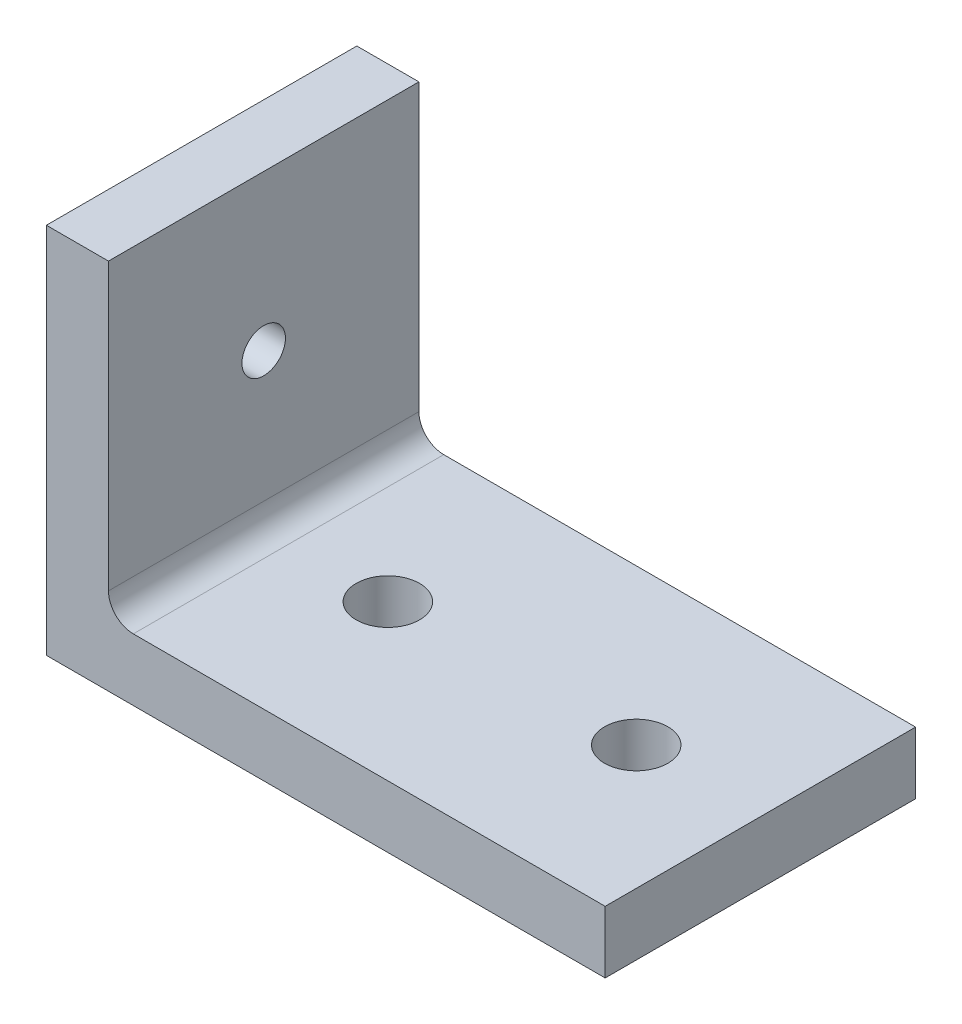
ISO-10303-21;
HEADER;
FILE_DESCRIPTION(('STEP AP214'),'2;1');
FILE_NAME('part.step','',(''),(''),'','','');
FILE_SCHEMA(('AUTOMOTIVE_DESIGN { 1 0 10303 214 1 1 1 1 }'));
ENDSEC;
DATA;
#1=APPLICATION_CONTEXT('core data for automotive mechanical design processes');
#2=APPLICATION_PROTOCOL_DEFINITION('international standard','automotive_design',2000,#1);
#3=PRODUCT_CONTEXT('',#1,'mechanical');
#4=PRODUCT('Part','Part','',(#3));
#5=PRODUCT_RELATED_PRODUCT_CATEGORY('part','',(#4));
#6=PRODUCT_DEFINITION_FORMATION('','',#4);
#7=PRODUCT_DEFINITION_CONTEXT('part definition',#1,'design');
#8=PRODUCT_DEFINITION('design','',#6,#7);
#9=PRODUCT_DEFINITION_SHAPE('','',#8);
#10=(LENGTH_UNIT() NAMED_UNIT(*) SI_UNIT(.MILLI.,.METRE.));
#11=(NAMED_UNIT(*) PLANE_ANGLE_UNIT() SI_UNIT($,.RADIAN.));
#12=(NAMED_UNIT(*) SI_UNIT($,.STERADIAN.) SOLID_ANGLE_UNIT());
#13=UNCERTAINTY_MEASURE_WITH_UNIT(LENGTH_MEASURE(1.E-05),#10,'distance_accuracy_value','');
#14=(GEOMETRIC_REPRESENTATION_CONTEXT(3) GLOBAL_UNCERTAINTY_ASSIGNED_CONTEXT((#13)) GLOBAL_UNIT_ASSIGNED_CONTEXT((#10,
#11,#12)) REPRESENTATION_CONTEXT('',''));
#15=CARTESIAN_POINT('',(0.,0.,0.));
#16=DIRECTION('',(0.,0.,1.));
#17=DIRECTION('',(1.,0.,0.));
#18=AXIS2_PLACEMENT_3D('',#15,#16,#17);
#19=CARTESIAN_POINT('',(45.,5.,25.));
#20=DIRECTION('',(0.,-1.,0.));
#21=DIRECTION('',(0.,0.,-1.));
#22=AXIS2_PLACEMENT_3D('',#19,#20,#21);
#23=PLANE('',#22);
#24=CARTESIAN_POINT('',(35.,5.,12.5));
#25=DIRECTION('',(0.,1.,0.));
#26=DIRECTION('',(0.,0.,1.));
#27=AXIS2_PLACEMENT_3D('',#24,#25,#26);
#28=CIRCLE('',#27,2.55);
#29=CARTESIAN_POINT('',(35.,5.,15.05));
#30=VERTEX_POINT('',#29);
#31=EDGE_CURVE('E183',#30,#30,#28,.T.);
#32=ORIENTED_EDGE('',*,*,#31,.F.);
#33=EDGE_LOOP('',(#32));
#34=FACE_BOUND('',#33,.T.);
#35=CARTESIAN_POINT('',(15.,5.,12.5));
#36=DIRECTION('',(0.,1.,0.));
#37=DIRECTION('',(0.,0.,1.));
#38=AXIS2_PLACEMENT_3D('',#35,#36,#37);
#39=CIRCLE('',#38,2.55);
#40=CARTESIAN_POINT('',(15.,5.,15.05));
#41=VERTEX_POINT('',#40);
#42=EDGE_CURVE('E190',#41,#41,#39,.T.);
#43=ORIENTED_EDGE('',*,*,#42,.F.);
#44=EDGE_LOOP('',(#43));
#45=FACE_BOUND('',#44,.T.);
#46=DIRECTION('',(-1.,0.,0.));
#47=VECTOR('',#46,1.);
#48=CARTESIAN_POINT('',(45.,5.,0.));
#49=LINE('',#48,#47);
#50=CARTESIAN_POINT('',(45.,5.,0.));
#51=VERTEX_POINT('',#50);
#52=CARTESIAN_POINT('',(7.,5.,0.));
#53=VERTEX_POINT('',#52);
#54=EDGE_CURVE('E140',#51,#53,#49,.T.);
#55=ORIENTED_EDGE('',*,*,#54,.T.);
#56=DIRECTION('',(0.,0.,-1.));
#57=VECTOR('',#56,1.);
#58=CARTESIAN_POINT('',(7.,5.,25.));
#59=LINE('',#58,#57);
#60=CARTESIAN_POINT('',(7.,5.,25.));
#61=VERTEX_POINT('',#60);
#62=EDGE_CURVE('E57',#53,#61,#59,.F.);
#63=ORIENTED_EDGE('',*,*,#62,.T.);
#64=DIRECTION('',(-1.,0.,0.));
#65=VECTOR('',#64,1.);
#66=CARTESIAN_POINT('',(45.,5.,25.));
#67=LINE('',#66,#65);
#68=CARTESIAN_POINT('',(45.,5.,25.));
#69=VERTEX_POINT('',#68);
#70=EDGE_CURVE('E111',#69,#61,#67,.T.);
#71=ORIENTED_EDGE('',*,*,#70,.F.);
#72=DIRECTION('',(0.,0.,-1.));
#73=VECTOR('',#72,1.);
#74=CARTESIAN_POINT('',(45.,5.,25.));
#75=LINE('',#74,#73);
#76=EDGE_CURVE('E139',#69,#51,#75,.T.);
#77=ORIENTED_EDGE('',*,*,#76,.T.);
#78=EDGE_LOOP('',(#55,#63,#71,#77));
#79=FACE_BOUND('',#78,.T.);
#80=ADVANCED_FACE('F39',(#34,#45,#79),#23,.F.);
#81=CARTESIAN_POINT('',(5.,5.,25.));
#82=DIRECTION('',(-1.,0.,0.));
#83=DIRECTION('',(0.,0.,1.));
#84=AXIS2_PLACEMENT_3D('',#81,#82,#83);
#85=PLANE('',#84);
#86=CARTESIAN_POINT('',(5.,17.5,12.5));
#87=DIRECTION('',(1.,0.,0.));
#88=DIRECTION('',(0.,0.,-1.));
#89=AXIS2_PLACEMENT_3D('',#86,#87,#88);
#90=CIRCLE('',#89,1.75);
#91=CARTESIAN_POINT('',(5.,17.5,10.75));
#92=VERTEX_POINT('',#91);
#93=EDGE_CURVE('E174',#92,#92,#90,.T.);
#94=ORIENTED_EDGE('',*,*,#93,.F.);
#95=EDGE_LOOP('',(#94));
#96=FACE_BOUND('',#95,.T.);
#97=DIRECTION('',(0.,1.,0.));
#98=VECTOR('',#97,1.);
#99=CARTESIAN_POINT('',(5.,5.,25.));
#100=LINE('',#99,#98);
#101=CARTESIAN_POINT('',(5.,7.,25.));
#102=VERTEX_POINT('',#101);
#103=CARTESIAN_POINT('',(5.,30.,25.));
#104=VERTEX_POINT('',#103);
#105=EDGE_CURVE('E100',#102,#104,#100,.T.);
#106=ORIENTED_EDGE('',*,*,#105,.F.);
#107=DIRECTION('',(0.,0.,-1.));
#108=VECTOR('',#107,1.);
#109=CARTESIAN_POINT('',(5.,7.,0.));
#110=LINE('',#109,#108);
#111=CARTESIAN_POINT('',(5.,7.,0.));
#112=VERTEX_POINT('',#111);
#113=EDGE_CURVE('E120',#102,#112,#110,.T.);
#114=ORIENTED_EDGE('',*,*,#113,.T.);
#115=DIRECTION('',(0.,1.,0.));
#116=VECTOR('',#115,1.);
#117=CARTESIAN_POINT('',(5.,5.,0.));
#118=LINE('',#117,#116);
#119=CARTESIAN_POINT('',(5.,30.,0.));
#120=VERTEX_POINT('',#119);
#121=EDGE_CURVE('E116',#112,#120,#118,.T.);
#122=ORIENTED_EDGE('',*,*,#121,.T.);
#123=DIRECTION('',(0.,0.,-1.));
#124=VECTOR('',#123,1.);
#125=CARTESIAN_POINT('',(5.,30.,25.));
#126=LINE('',#125,#124);
#127=EDGE_CURVE('E114',#104,#120,#126,.T.);
#128=ORIENTED_EDGE('',*,*,#127,.F.);
#129=EDGE_LOOP('',(#106,#114,#122,#128));
#130=FACE_BOUND('',#129,.T.);
#131=ADVANCED_FACE('F115',(#96,#130),#85,.F.);
#132=CARTESIAN_POINT('',(5.,30.,25.));
#133=DIRECTION('',(0.,-1.,0.));
#134=DIRECTION('',(0.,0.,-1.));
#135=AXIS2_PLACEMENT_3D('',#132,#133,#134);
#136=PLANE('',#135);
#137=DIRECTION('',(-1.,0.,0.));
#138=VECTOR('',#137,1.);
#139=CARTESIAN_POINT('',(5.,30.,0.));
#140=LINE('',#139,#138);
#141=CARTESIAN_POINT('',(0.,30.,0.));
#142=VERTEX_POINT('',#141);
#143=EDGE_CURVE('E146',#120,#142,#140,.T.);
#144=ORIENTED_EDGE('',*,*,#143,.T.);
#145=DIRECTION('',(0.,0.,-1.));
#146=VECTOR('',#145,1.);
#147=CARTESIAN_POINT('',(0.,30.,25.));
#148=LINE('',#147,#146);
#149=CARTESIAN_POINT('',(0.,30.,25.));
#150=VERTEX_POINT('',#149);
#151=EDGE_CURVE('E121',#150,#142,#148,.T.);
#152=ORIENTED_EDGE('',*,*,#151,.F.);
#153=DIRECTION('',(-1.,0.,0.));
#154=VECTOR('',#153,1.);
#155=CARTESIAN_POINT('',(5.,30.,25.));
#156=LINE('',#155,#154);
#157=EDGE_CURVE('E104',#104,#150,#156,.T.);
#158=ORIENTED_EDGE('',*,*,#157,.F.);
#159=ORIENTED_EDGE('',*,*,#127,.T.);
#160=EDGE_LOOP('',(#144,#152,#158,#159));
#161=FACE_BOUND('',#160,.T.);
#162=ADVANCED_FACE('F123',(#161),#136,.F.);
#163=CARTESIAN_POINT('',(0.,30.,25.));
#164=DIRECTION('',(1.,0.,0.));
#165=DIRECTION('',(0.,0.,-1.));
#166=AXIS2_PLACEMENT_3D('',#163,#164,#165);
#167=PLANE('',#166);
#168=CARTESIAN_POINT('',(0.,17.5,12.5));
#169=DIRECTION('',(1.,0.,0.));
#170=DIRECTION('',(0.,0.,-1.));
#171=AXIS2_PLACEMENT_3D('',#168,#169,#170);
#172=CIRCLE('',#171,1.75);
#173=CARTESIAN_POINT('',(0.,17.5,10.75));
#174=VERTEX_POINT('',#173);
#175=EDGE_CURVE('E143',#174,#174,#172,.T.);
#176=ORIENTED_EDGE('',*,*,#175,.T.);
#177=EDGE_LOOP('',(#176));
#178=FACE_BOUND('',#177,.T.);
#179=DIRECTION('',(0.,-1.,0.));
#180=VECTOR('',#179,1.);
#181=CARTESIAN_POINT('',(0.,30.,0.));
#182=LINE('',#181,#180);
#183=CARTESIAN_POINT('',(0.,0.,0.));
#184=VERTEX_POINT('',#183);
#185=EDGE_CURVE('E149',#142,#184,#182,.T.);
#186=ORIENTED_EDGE('',*,*,#185,.T.);
#187=DIRECTION('',(0.,0.,-1.));
#188=VECTOR('',#187,1.);
#189=CARTESIAN_POINT('',(0.,0.,25.));
#190=LINE('',#189,#188);
#191=CARTESIAN_POINT('',(0.,0.,25.));
#192=VERTEX_POINT('',#191);
#193=EDGE_CURVE('E165',#192,#184,#190,.T.);
#194=ORIENTED_EDGE('',*,*,#193,.F.);
#195=DIRECTION('',(0.,-1.,0.));
#196=VECTOR('',#195,1.);
#197=CARTESIAN_POINT('',(0.,30.,25.));
#198=LINE('',#197,#196);
#199=EDGE_CURVE('E127',#150,#192,#198,.T.);
#200=ORIENTED_EDGE('',*,*,#199,.F.);
#201=ORIENTED_EDGE('',*,*,#151,.T.);
#202=EDGE_LOOP('',(#186,#194,#200,#201));
#203=FACE_BOUND('',#202,.T.);
#204=ADVANCED_FACE('F208',(#178,#203),#167,.F.);
#205=CARTESIAN_POINT('',(0.,0.,25.));
#206=DIRECTION('',(0.,1.,0.));
#207=DIRECTION('',(0.,0.,1.));
#208=AXIS2_PLACEMENT_3D('',#205,#206,#207);
#209=PLANE('',#208);
#210=CARTESIAN_POINT('',(35.,0.,12.5));
#211=DIRECTION('',(0.,1.,0.));
#212=DIRECTION('',(0.,0.,1.));
#213=AXIS2_PLACEMENT_3D('',#210,#211,#212);
#214=CIRCLE('',#213,2.55);
#215=CARTESIAN_POINT('',(35.,0.,15.05));
#216=VERTEX_POINT('',#215);
#217=EDGE_CURVE('E43',#216,#216,#214,.T.);
#218=ORIENTED_EDGE('',*,*,#217,.T.);
#219=EDGE_LOOP('',(#218));
#220=FACE_BOUND('',#219,.T.);
#221=CARTESIAN_POINT('',(15.,0.,12.5));
#222=DIRECTION('',(0.,1.,0.));
#223=DIRECTION('',(0.,0.,1.));
#224=AXIS2_PLACEMENT_3D('',#221,#222,#223);
#225=CIRCLE('',#224,2.55);
#226=CARTESIAN_POINT('',(15.,0.,15.05));
#227=VERTEX_POINT('',#226);
#228=EDGE_CURVE('E180',#227,#227,#225,.T.);
#229=ORIENTED_EDGE('',*,*,#228,.T.);
#230=EDGE_LOOP('',(#229));
#231=FACE_BOUND('',#230,.T.);
#232=DIRECTION('',(1.,0.,0.));
#233=VECTOR('',#232,1.);
#234=CARTESIAN_POINT('',(0.,0.,0.));
#235=LINE('',#234,#233);
#236=CARTESIAN_POINT('',(45.,0.,0.));
#237=VERTEX_POINT('',#236);
#238=EDGE_CURVE('E152',#184,#237,#235,.T.);
#239=ORIENTED_EDGE('',*,*,#238,.T.);
#240=DIRECTION('',(0.,0.,-1.));
#241=VECTOR('',#240,1.);
#242=CARTESIAN_POINT('',(45.,0.,25.));
#243=LINE('',#242,#241);
#244=CARTESIAN_POINT('',(45.,0.,25.));
#245=VERTEX_POINT('',#244);
#246=EDGE_CURVE('E161',#245,#237,#243,.T.);
#247=ORIENTED_EDGE('',*,*,#246,.F.);
#248=DIRECTION('',(1.,0.,0.));
#249=VECTOR('',#248,1.);
#250=CARTESIAN_POINT('',(0.,0.,25.));
#251=LINE('',#250,#249);
#252=EDGE_CURVE('E130',#192,#245,#251,.T.);
#253=ORIENTED_EDGE('',*,*,#252,.F.);
#254=ORIENTED_EDGE('',*,*,#193,.T.);
#255=EDGE_LOOP('',(#239,#247,#253,#254));
#256=FACE_BOUND('',#255,.T.);
#257=ADVANCED_FACE('F213',(#220,#231,#256),#209,.F.);
#258=CARTESIAN_POINT('',(45.,0.,25.));
#259=DIRECTION('',(-1.,0.,0.));
#260=DIRECTION('',(0.,0.,1.));
#261=AXIS2_PLACEMENT_3D('',#258,#259,#260);
#262=PLANE('',#261);
#263=DIRECTION('',(0.,1.,0.));
#264=VECTOR('',#263,1.);
#265=CARTESIAN_POINT('',(45.,0.,0.));
#266=LINE('',#265,#264);
#267=EDGE_CURVE('E155',#237,#51,#266,.T.);
#268=ORIENTED_EDGE('',*,*,#267,.T.);
#269=ORIENTED_EDGE('',*,*,#76,.F.);
#270=DIRECTION('',(0.,1.,0.));
#271=VECTOR('',#270,1.);
#272=CARTESIAN_POINT('',(45.,0.,25.));
#273=LINE('',#272,#271);
#274=EDGE_CURVE('E136',#245,#69,#273,.T.);
#275=ORIENTED_EDGE('',*,*,#274,.F.);
#276=ORIENTED_EDGE('',*,*,#246,.T.);
#277=EDGE_LOOP('',(#268,#269,#275,#276));
#278=FACE_BOUND('',#277,.T.);
#279=ADVANCED_FACE('F216',(#278),#262,.F.);
#280=CARTESIAN_POINT('',(0.,0.,25.));
#281=DIRECTION('',(0.,0.,-1.));
#282=DIRECTION('',(-1.,0.,0.));
#283=AXIS2_PLACEMENT_3D('',#280,#281,#282);
#284=PLANE('',#283);
#285=ORIENTED_EDGE('',*,*,#70,.T.);
#286=CARTESIAN_POINT('',(7.,7.,25.));
#287=DIRECTION('',(0.,0.,-1.));
#288=DIRECTION('',(-1.,0.,0.));
#289=AXIS2_PLACEMENT_3D('',#286,#287,#288);
#290=CIRCLE('',#289,2.);
#291=EDGE_CURVE('E11',#61,#102,#290,.T.);
#292=ORIENTED_EDGE('',*,*,#291,.T.);
#293=ORIENTED_EDGE('',*,*,#105,.T.);
#294=ORIENTED_EDGE('',*,*,#157,.T.);
#295=ORIENTED_EDGE('',*,*,#199,.T.);
#296=ORIENTED_EDGE('',*,*,#252,.T.);
#297=ORIENTED_EDGE('',*,*,#274,.T.);
#298=EDGE_LOOP('',(#285,#292,#293,#294,#295,#296,#297));
#299=FACE_BOUND('',#298,.T.);
#300=ADVANCED_FACE('F102',(#299),#284,.F.);
#301=CARTESIAN_POINT('',(0.,0.,0.));
#302=DIRECTION('',(0.,0.,-1.));
#303=DIRECTION('',(-1.,0.,0.));
#304=AXIS2_PLACEMENT_3D('',#301,#302,#303);
#305=PLANE('',#304);
#306=ORIENTED_EDGE('',*,*,#54,.F.);
#307=ORIENTED_EDGE('',*,*,#267,.F.);
#308=ORIENTED_EDGE('',*,*,#238,.F.);
#309=ORIENTED_EDGE('',*,*,#185,.F.);
#310=ORIENTED_EDGE('',*,*,#143,.F.);
#311=ORIENTED_EDGE('',*,*,#121,.F.);
#312=CARTESIAN_POINT('',(7.,7.,0.));
#313=DIRECTION('',(0.,0.,-1.));
#314=DIRECTION('',(-1.,0.,0.));
#315=AXIS2_PLACEMENT_3D('',#312,#313,#314);
#316=CIRCLE('',#315,2.);
#317=EDGE_CURVE('E49',#112,#53,#316,.F.);
#318=ORIENTED_EDGE('',*,*,#317,.T.);
#319=EDGE_LOOP('',(#306,#307,#308,#309,#310,#311,#318));
#320=FACE_BOUND('',#319,.T.);
#321=ADVANCED_FACE('F204',(#320),#305,.T.);
#322=CARTESIAN_POINT('',(-20.,17.5,12.5));
#323=DIRECTION('',(1.,0.,0.));
#324=DIRECTION('',(0.,0.,-1.));
#325=AXIS2_PLACEMENT_3D('',#322,#323,#324);
#326=CYLINDRICAL_SURFACE('',#325,1.75);
#327=ORIENTED_EDGE('',*,*,#93,.T.);
#328=EDGE_LOOP('',(#327));
#329=FACE_BOUND('',#328,.T.);
#330=ORIENTED_EDGE('',*,*,#175,.F.);
#331=EDGE_LOOP('',(#330));
#332=FACE_BOUND('',#331,.T.);
#333=ADVANCED_FACE('F238',(#329,#332),#326,.F.);
#334=CARTESIAN_POINT('',(7.,7.,25.));
#335=DIRECTION('',(0.,0.,1.));
#336=DIRECTION('',(1.,0.,0.));
#337=AXIS2_PLACEMENT_3D('',#334,#335,#336);
#338=CYLINDRICAL_SURFACE('',#337,2.);
#339=ORIENTED_EDGE('',*,*,#291,.F.);
#340=ORIENTED_EDGE('',*,*,#62,.F.);
#341=ORIENTED_EDGE('',*,*,#317,.F.);
#342=ORIENTED_EDGE('',*,*,#113,.F.);
#343=EDGE_LOOP('',(#339,#340,#341,#342));
#344=FACE_BOUND('',#343,.T.);
#345=ADVANCED_FACE('F41',(#344),#338,.F.);
#346=CARTESIAN_POINT('',(15.,-20.,12.5));
#347=DIRECTION('',(0.,1.,0.));
#348=DIRECTION('',(0.,0.,1.));
#349=AXIS2_PLACEMENT_3D('',#346,#347,#348);
#350=CYLINDRICAL_SURFACE('',#349,2.55);
#351=ORIENTED_EDGE('',*,*,#42,.T.);
#352=EDGE_LOOP('',(#351));
#353=FACE_BOUND('',#352,.T.);
#354=ORIENTED_EDGE('',*,*,#228,.F.);
#355=EDGE_LOOP('',(#354));
#356=FACE_BOUND('',#355,.T.);
#357=ADVANCED_FACE('F244',(#353,#356),#350,.F.);
#358=CARTESIAN_POINT('',(35.,-20.,12.5));
#359=DIRECTION('',(0.,1.,0.));
#360=DIRECTION('',(0.,0.,1.));
#361=AXIS2_PLACEMENT_3D('',#358,#359,#360);
#362=CYLINDRICAL_SURFACE('',#361,2.55);
#363=ORIENTED_EDGE('',*,*,#31,.T.);
#364=EDGE_LOOP('',(#363));
#365=FACE_BOUND('',#364,.T.);
#366=ORIENTED_EDGE('',*,*,#217,.F.);
#367=EDGE_LOOP('',(#366));
#368=FACE_BOUND('',#367,.T.);
#369=ADVANCED_FACE('F247',(#365,#368),#362,.F.);
#370=CLOSED_SHELL('',(#80,#131,#162,#204,#257,#279,#300,#321,#333,#345,#357,#369));
#371=MANIFOLD_SOLID_BREP('B2',#370);
#372=ADVANCED_BREP_SHAPE_REPRESENTATION('',(#18,#371),#14);
#373=SHAPE_DEFINITION_REPRESENTATION(#9,#372);
ENDSEC;
END-ISO-10303-21;
